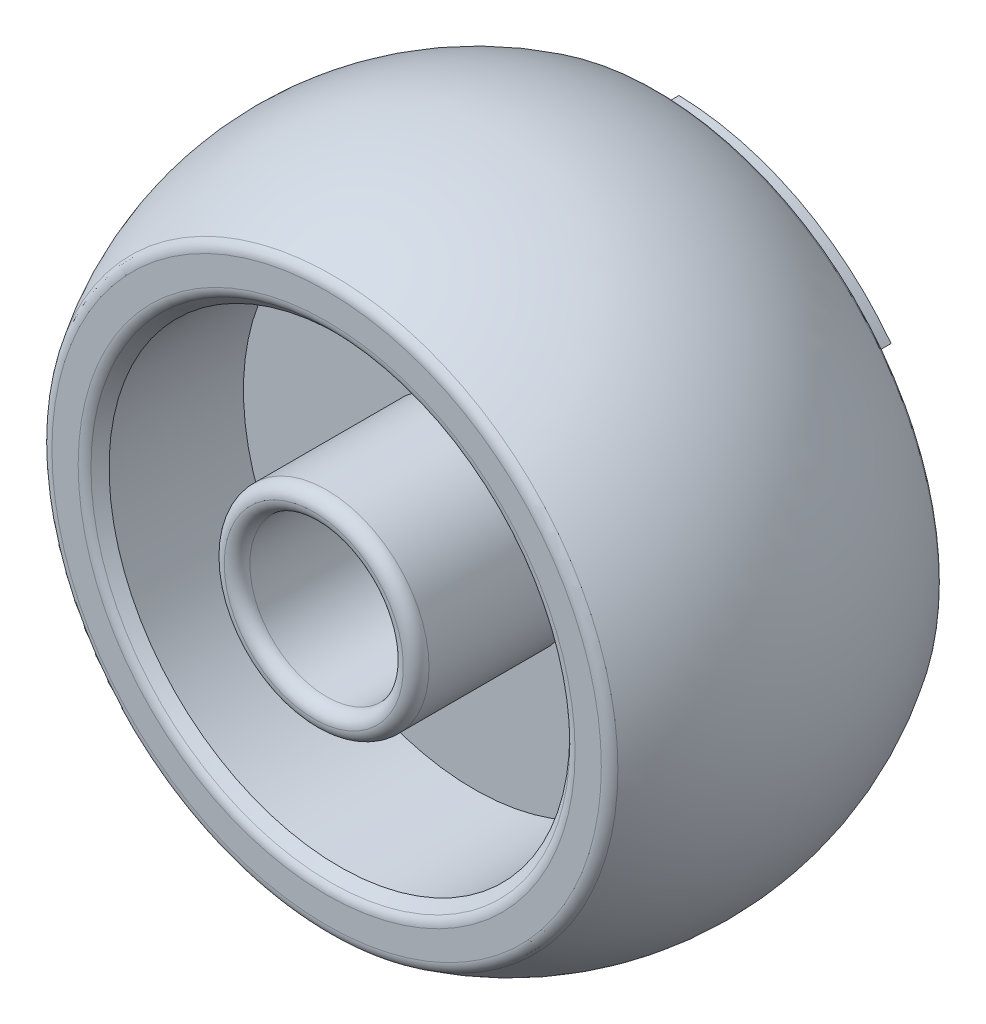
ISO-10303-21;
HEADER;
FILE_DESCRIPTION(('STEP AP214'),'2;1');
FILE_NAME('part.step','',(''),(''),'','','');
FILE_SCHEMA(('AUTOMOTIVE_DESIGN { 1 0 10303 214 1 1 1 1 }'));
ENDSEC;
DATA;
#1=APPLICATION_CONTEXT('core data for automotive mechanical design processes');
#2=APPLICATION_PROTOCOL_DEFINITION('international standard','automotive_design',2000,#1);
#3=PRODUCT_CONTEXT('',#1,'mechanical');
#4=PRODUCT('Part','Part','',(#3));
#5=PRODUCT_RELATED_PRODUCT_CATEGORY('part','',(#4));
#6=PRODUCT_DEFINITION_FORMATION('','',#4);
#7=PRODUCT_DEFINITION_CONTEXT('part definition',#1,'design');
#8=PRODUCT_DEFINITION('design','',#6,#7);
#9=PRODUCT_DEFINITION_SHAPE('','',#8);
#10=(LENGTH_UNIT() NAMED_UNIT(*) SI_UNIT(.MILLI.,.METRE.));
#11=(NAMED_UNIT(*) PLANE_ANGLE_UNIT() SI_UNIT($,.RADIAN.));
#12=(NAMED_UNIT(*) SI_UNIT($,.STERADIAN.) SOLID_ANGLE_UNIT());
#13=UNCERTAINTY_MEASURE_WITH_UNIT(LENGTH_MEASURE(1.E-05),#10,'distance_accuracy_value','');
#14=(GEOMETRIC_REPRESENTATION_CONTEXT(3) GLOBAL_UNCERTAINTY_ASSIGNED_CONTEXT((#13)) GLOBAL_UNIT_ASSIGNED_CONTEXT((#10,
#11,#12)) REPRESENTATION_CONTEXT('',''));
#15=CARTESIAN_POINT('',(0.,0.,0.));
#16=DIRECTION('',(0.,0.,1.));
#17=DIRECTION('',(1.,0.,0.));
#18=AXIS2_PLACEMENT_3D('',#15,#16,#17);
#19=CARTESIAN_POINT('',(0.,19.,-13.));
#20=DIRECTION('',(0.,0.,1.));
#21=DIRECTION('',(1.,0.,0.));
#22=AXIS2_PLACEMENT_3D('',#19,#20,#21);
#23=PLANE('',#22);
#24=DIRECTION('',(0.85329980647171,-0.521420598246121,0.));
#25=VECTOR('',#24,1.);
#26=CARTESIAN_POINT('',(16.5661446755735,-10.1229708501703,-13.));
#27=LINE('',#26,#25);
#28=CARTESIAN_POINT('',(16.5661446755735,-10.1229708501703,-13.));
#29=VERTEX_POINT('',#28);
#30=CARTESIAN_POINT('',(18.31441692079,-11.1912766825215,-13.));
#31=VERTEX_POINT('',#30);
#32=EDGE_CURVE('E53',#29,#31,#27,.T.);
#33=ORIENTED_EDGE('',*,*,#32,.F.);
#34=CARTESIAN_POINT('',(0.,0.,-13.));
#35=DIRECTION('',(0.,0.,1.));
#36=DIRECTION('',(1.,0.,0.));
#37=AXIS2_PLACEMENT_3D('',#34,#35,#36);
#38=CIRCLE('',#37,19.4142135623731);
#39=CARTESIAN_POINT('',(15.4755000882901,11.7226526547008,-13.));
#40=VERTEX_POINT('',#39);
#41=EDGE_CURVE('E268',#29,#40,#38,.T.);
#42=ORIENTED_EDGE('',*,*,#41,.T.);
#43=DIRECTION('',(-0.797122172297691,-0.603818054078718,0.));
#44=VECTOR('',#43,1.);
#45=CARTESIAN_POINT('',(15.4755000882901,11.7226526547008,-13.));
#46=LINE('',#45,#44);
#47=CARTESIAN_POINT('',(17.1086735160881,12.9597774461283,-13.));
#48=VERTEX_POINT('',#47);
#49=EDGE_CURVE('E194',#48,#40,#46,.T.);
#50=ORIENTED_EDGE('',*,*,#49,.F.);
#51=CARTESIAN_POINT('',(0.,0.,-13.));
#52=DIRECTION('',(0.,0.,1.));
#53=DIRECTION('',(1.,0.,0.));
#54=AXIS2_PLACEMENT_3D('',#51,#52,#53);
#55=CIRCLE('',#54,21.4630505970906);
#56=EDGE_CURVE('E269',#48,#31,#55,.F.);
#57=ORIENTED_EDGE('',*,*,#56,.T.);
#58=EDGE_LOOP('',(#33,#42,#50,#57));
#59=FACE_BOUND('',#58,.T.);
#60=ADVANCED_FACE('F38',(#59),#23,.F.);
#61=DIRECTION('',(-0.12436068794702,0.992237078168995,0.));
#62=VECTOR('',#61,1.);
#63=CARTESIAN_POINT('',(2.41436495456709,-19.2635025400779,-13.));
#64=LINE('',#63,#62);
#65=CARTESIAN_POINT('',(2.66915973769589,-21.2964346130505,-13.));
#66=VERTEX_POINT('',#65);
#67=CARTESIAN_POINT('',(2.41436495456709,-19.263502540078,-13.));
#68=VERTEX_POINT('',#67);
#69=EDGE_CURVE('E148',#66,#68,#64,.T.);
#70=ORIENTED_EDGE('',*,*,#69,.F.);
#71=CARTESIAN_POINT('',(-18.8491383682392,-10.2651119676429,-13.));
#72=VERTEX_POINT('',#71);
#73=EDGE_CURVE('E270',#66,#72,#55,.F.);
#74=ORIENTED_EDGE('',*,*,#73,.T.);
#75=DIRECTION('',(-0.878213387373473,-0.478269010325791,0.));
#76=VECTOR('',#75,1.);
#77=CARTESIAN_POINT('',(-17.0498222558037,-9.28521670672971,-13.));
#78=LINE('',#77,#76);
#79=CARTESIAN_POINT('',(-17.0498222558037,-9.28521670672971,-13.));
#80=VERTEX_POINT('',#79);
#81=EDGE_CURVE('E154',#80,#72,#78,.T.);
#82=ORIENTED_EDGE('',*,*,#81,.F.);
#83=EDGE_CURVE('E331',#80,#68,#38,.T.);
#84=ORIENTED_EDGE('',*,*,#83,.T.);
#85=EDGE_LOOP('',(#70,#74,#82,#84));
#86=FACE_BOUND('',#85,.T.);
#87=ADVANCED_FACE('F330',(#86),#23,.F.);
#88=DIRECTION('',(0.921482860244703,-0.388419024090274,0.));
#89=VECTOR('',#88,1.);
#90=CARTESIAN_POINT('',(-17.8898650428571,7.5408498853771,-13.));
#91=LINE('',#90,#89);
#92=CARTESIAN_POINT('',(-19.7778332537838,8.33665716692208,-13.));
#93=VERTEX_POINT('',#92);
#94=CARTESIAN_POINT('',(-17.8898650428571,7.5408498853771,-13.));
#95=VERTEX_POINT('',#94);
#96=EDGE_CURVE('E164',#93,#95,#91,.T.);
#97=ORIENTED_EDGE('',*,*,#96,.F.);
#98=CARTESIAN_POINT('',(0.534721447449292,21.4563886501645,-13.));
#99=VERTEX_POINT('',#98);
#100=EDGE_CURVE('E264',#93,#99,#55,.F.);
#101=ORIENTED_EDGE('',*,*,#100,.T.);
#102=DIRECTION('',(0.0249135809017653,0.999689608571906,0.));
#103=VECTOR('',#102,1.);
#104=CARTESIAN_POINT('',(0.483677580230324,19.4081875569002,-13.));
#105=LINE('',#104,#103);
#106=CARTESIAN_POINT('',(0.483677580230324,19.4081875569002,-13.));
#107=VERTEX_POINT('',#106);
#108=EDGE_CURVE('E189',#107,#99,#105,.T.);
#109=ORIENTED_EDGE('',*,*,#108,.F.);
#110=EDGE_CURVE('E273',#107,#95,#38,.T.);
#111=ORIENTED_EDGE('',*,*,#110,.T.);
#112=EDGE_LOOP('',(#97,#101,#109,#111));
#113=FACE_BOUND('',#112,.T.);
#114=ADVANCED_FACE('F310',(#113),#23,.F.);
#115=CARTESIAN_POINT('',(0.,0.,13.));
#116=DIRECTION('',(0.,0.,1.));
#117=DIRECTION('',(1.,0.,0.));
#118=AXIS2_PLACEMENT_3D('',#115,#116,#117);
#119=CONICAL_SURFACE('',#118,19.,0.785398163397453);
#120=CARTESIAN_POINT('',(0.,0.,12.7071067811865));
#121=DIRECTION('',(0.,0.,-1.));
#122=DIRECTION('',(-1.,0.,0.));
#123=AXIS2_PLACEMENT_3D('',#120,#121,#122);
#124=CIRCLE('',#123,18.7071067811865);
#125=CARTESIAN_POINT('',(-18.7071067811865,0.,12.7071067811865));
#126=VERTEX_POINT('',#125);
#127=EDGE_CURVE('E261',#126,#126,#124,.F.);
#128=ORIENTED_EDGE('',*,*,#127,.T.);
#129=EDGE_LOOP('',(#128));
#130=FACE_BOUND('',#129,.T.);
#131=CARTESIAN_POINT('',(0.,0.,12.));
#132=DIRECTION('',(0.,0.,1.));
#133=DIRECTION('',(1.,0.,0.));
#134=AXIS2_PLACEMENT_3D('',#131,#132,#133);
#135=CIRCLE('',#134,18.);
#136=CARTESIAN_POINT('',(18.,0.,12.));
#137=VERTEX_POINT('',#136);
#138=EDGE_CURVE('E233',#137,#137,#135,.T.);
#139=ORIENTED_EDGE('',*,*,#138,.F.);
#140=EDGE_LOOP('',(#139));
#141=FACE_BOUND('',#140,.T.);
#142=ADVANCED_FACE('F365',(#130,#141),#119,.F.);
#143=CARTESIAN_POINT('',(0.,0.,9.42942299976632));
#144=DIRECTION('',(0.,0.,1.));
#145=DIRECTION('',(1.,0.,0.));
#146=AXIS2_PLACEMENT_3D('',#143,#144,#145);
#147=CYLINDRICAL_SURFACE('',#146,18.);
#148=CARTESIAN_POINT('',(0.,0.,1.5));
#149=DIRECTION('',(0.,0.,1.));
#150=DIRECTION('',(1.,0.,0.));
#151=AXIS2_PLACEMENT_3D('',#148,#149,#150);
#152=CIRCLE('',#151,18.);
#153=CARTESIAN_POINT('',(18.,0.,1.5));
#154=VERTEX_POINT('',#153);
#155=EDGE_CURVE('E230',#154,#154,#152,.T.);
#156=ORIENTED_EDGE('',*,*,#155,.F.);
#157=EDGE_LOOP('',(#156));
#158=FACE_BOUND('',#157,.T.);
#159=ORIENTED_EDGE('',*,*,#138,.T.);
#160=EDGE_LOOP('',(#159));
#161=FACE_BOUND('',#160,.T.);
#162=ADVANCED_FACE('F369',(#158,#161),#147,.F.);
#163=CARTESIAN_POINT('',(0.,8.,1.5));
#164=DIRECTION('',(0.,0.,-1.));
#165=DIRECTION('',(-1.,0.,0.));
#166=AXIS2_PLACEMENT_3D('',#163,#164,#165);
#167=PLANE('',#166);
#168=CARTESIAN_POINT('',(0.,0.,1.5));
#169=DIRECTION('',(0.,0.,1.));
#170=DIRECTION('',(1.,0.,0.));
#171=AXIS2_PLACEMENT_3D('',#168,#169,#170);
#172=CIRCLE('',#171,8.);
#173=CARTESIAN_POINT('',(8.,0.,1.5));
#174=VERTEX_POINT('',#173);
#175=EDGE_CURVE('E227',#174,#174,#172,.T.);
#176=ORIENTED_EDGE('',*,*,#175,.F.);
#177=EDGE_LOOP('',(#176));
#178=FACE_BOUND('',#177,.T.);
#179=ORIENTED_EDGE('',*,*,#155,.T.);
#180=EDGE_LOOP('',(#179));
#181=FACE_BOUND('',#180,.T.);
#182=ADVANCED_FACE('F375',(#178,#181),#167,.F.);
#183=CARTESIAN_POINT('',(0.,0.,9.42942299976632));
#184=DIRECTION('',(0.,0.,1.));
#185=DIRECTION('',(1.,0.,0.));
#186=AXIS2_PLACEMENT_3D('',#183,#184,#185);
#187=CYLINDRICAL_SURFACE('',#186,8.);
#188=CARTESIAN_POINT('',(0.,0.,13.));
#189=DIRECTION('',(0.,0.,-1.));
#190=DIRECTION('',(-1.,0.,0.));
#191=AXIS2_PLACEMENT_3D('',#188,#189,#190);
#192=CIRCLE('',#191,8.);
#193=CARTESIAN_POINT('',(-8.,0.,13.));
#194=VERTEX_POINT('',#193);
#195=EDGE_CURVE('E242',#194,#194,#192,.T.);
#196=ORIENTED_EDGE('',*,*,#195,.T.);
#197=EDGE_LOOP('',(#196));
#198=FACE_BOUND('',#197,.T.);
#199=ORIENTED_EDGE('',*,*,#175,.T.);
#200=EDGE_LOOP('',(#199));
#201=FACE_BOUND('',#200,.T.);
#202=ADVANCED_FACE('F556',(#198,#201),#187,.T.);
#203=CARTESIAN_POINT('',(0.,0.,9.42942299976632));
#204=DIRECTION('',(0.,0.,1.));
#205=DIRECTION('',(1.,0.,0.));
#206=AXIS2_PLACEMENT_3D('',#203,#204,#205);
#207=CYLINDRICAL_SURFACE('',#206,6.);
#208=CARTESIAN_POINT('',(0.,0.,13.));
#209=DIRECTION('',(0.,0.,-1.));
#210=DIRECTION('',(-1.,0.,0.));
#211=AXIS2_PLACEMENT_3D('',#208,#209,#210);
#212=CIRCLE('',#211,6.);
#213=CARTESIAN_POINT('',(-6.,0.,13.));
#214=VERTEX_POINT('',#213);
#215=EDGE_CURVE('E247',#214,#214,#212,.F.);
#216=ORIENTED_EDGE('',*,*,#215,.T.);
#217=EDGE_LOOP('',(#216));
#218=FACE_BOUND('',#217,.T.);
#219=CARTESIAN_POINT('',(0.,0.,-13.));
#220=DIRECTION('',(0.,0.,1.));
#221=DIRECTION('',(1.,0.,0.));
#222=AXIS2_PLACEMENT_3D('',#219,#220,#221);
#223=CIRCLE('',#222,6.);
#224=CARTESIAN_POINT('',(6.,0.,-13.));
#225=VERTEX_POINT('',#224);
#226=EDGE_CURVE('E236',#225,#225,#223,.F.);
#227=ORIENTED_EDGE('',*,*,#226,.T.);
#228=EDGE_LOOP('',(#227));
#229=FACE_BOUND('',#228,.T.);
#230=ADVANCED_FACE('F565',(#218,#229),#207,.F.);
#231=CARTESIAN_POINT('',(0.,0.,9.42942299976632));
#232=DIRECTION('',(0.,0.,1.));
#233=DIRECTION('',(1.,0.,0.));
#234=AXIS2_PLACEMENT_3D('',#231,#232,#233);
#235=CYLINDRICAL_SURFACE('',#234,8.);
#236=CARTESIAN_POINT('',(0.,0.,-13.));
#237=DIRECTION('',(0.,0.,1.));
#238=DIRECTION('',(1.,0.,0.));
#239=AXIS2_PLACEMENT_3D('',#236,#237,#238);
#240=CIRCLE('',#239,8.);
#241=CARTESIAN_POINT('',(8.,0.,-13.));
#242=VERTEX_POINT('',#241);
#243=EDGE_CURVE('E239',#242,#242,#240,.T.);
#244=ORIENTED_EDGE('',*,*,#243,.T.);
#245=EDGE_LOOP('',(#244));
#246=FACE_BOUND('',#245,.T.);
#247=CARTESIAN_POINT('',(0.,0.,-1.5));
#248=DIRECTION('',(0.,0.,1.));
#249=DIRECTION('',(1.,0.,0.));
#250=AXIS2_PLACEMENT_3D('',#247,#248,#249);
#251=CIRCLE('',#250,8.);
#252=CARTESIAN_POINT('',(8.,0.,-1.5));
#253=VERTEX_POINT('',#252);
#254=EDGE_CURVE('E224',#253,#253,#251,.T.);
#255=ORIENTED_EDGE('',*,*,#254,.F.);
#256=EDGE_LOOP('',(#255));
#257=FACE_BOUND('',#256,.T.);
#258=ADVANCED_FACE('F637',(#246,#257),#235,.T.);
#259=CARTESIAN_POINT('',(0.,8.,-1.5));
#260=DIRECTION('',(0.,0.,1.));
#261=DIRECTION('',(1.,0.,0.));
#262=AXIS2_PLACEMENT_3D('',#259,#260,#261);
#263=PLANE('',#262);
#264=CARTESIAN_POINT('',(0.,0.,-1.5));
#265=DIRECTION('',(0.,0.,1.));
#266=DIRECTION('',(1.,0.,0.));
#267=AXIS2_PLACEMENT_3D('',#264,#265,#266);
#268=CIRCLE('',#267,18.);
#269=CARTESIAN_POINT('',(18.,0.,-1.5));
#270=VERTEX_POINT('',#269);
#271=EDGE_CURVE('E220',#270,#270,#268,.T.);
#272=ORIENTED_EDGE('',*,*,#271,.F.);
#273=EDGE_LOOP('',(#272));
#274=FACE_BOUND('',#273,.T.);
#275=ORIENTED_EDGE('',*,*,#254,.T.);
#276=EDGE_LOOP('',(#275));
#277=FACE_BOUND('',#276,.T.);
#278=ADVANCED_FACE('F646',(#274,#277),#263,.F.);
#279=CARTESIAN_POINT('',(0.,0.,9.42942299976632));
#280=DIRECTION('',(0.,0.,1.));
#281=DIRECTION('',(1.,0.,0.));
#282=AXIS2_PLACEMENT_3D('',#279,#280,#281);
#283=CYLINDRICAL_SURFACE('',#282,18.);
#284=CARTESIAN_POINT('',(0.,0.,-12.));
#285=DIRECTION('',(0.,0.,1.));
#286=DIRECTION('',(1.,0.,0.));
#287=AXIS2_PLACEMENT_3D('',#284,#285,#286);
#288=CIRCLE('',#287,18.);
#289=CARTESIAN_POINT('',(18.,0.,-12.));
#290=VERTEX_POINT('',#289);
#291=EDGE_CURVE('E217',#290,#290,#288,.T.);
#292=ORIENTED_EDGE('',*,*,#291,.F.);
#293=EDGE_LOOP('',(#292));
#294=FACE_BOUND('',#293,.T.);
#295=ORIENTED_EDGE('',*,*,#271,.T.);
#296=EDGE_LOOP('',(#295));
#297=FACE_BOUND('',#296,.T.);
#298=ADVANCED_FACE('F581',(#294,#297),#283,.F.);
#299=CARTESIAN_POINT('',(0.,0.,-12.));
#300=DIRECTION('',(0.,0.,-1.));
#301=DIRECTION('',(-1.,0.,0.));
#302=AXIS2_PLACEMENT_3D('',#299,#300,#301);
#303=CONICAL_SURFACE('',#302,18.,0.785398163397448);
#304=CARTESIAN_POINT('',(0.,0.,-12.7071067811865));
#305=DIRECTION('',(0.,0.,1.));
#306=DIRECTION('',(1.,0.,0.));
#307=AXIS2_PLACEMENT_3D('',#304,#305,#306);
#308=CIRCLE('',#307,18.7071067811865);
#309=CARTESIAN_POINT('',(18.7071067811865,0.,-12.7071067811865));
#310=VERTEX_POINT('',#309);
#311=EDGE_CURVE('E46',#310,#310,#308,.F.);
#312=ORIENTED_EDGE('',*,*,#311,.T.);
#313=EDGE_LOOP('',(#312));
#314=FACE_BOUND('',#313,.T.);
#315=ORIENTED_EDGE('',*,*,#291,.T.);
#316=EDGE_LOOP('',(#315));
#317=FACE_BOUND('',#316,.T.);
#318=ADVANCED_FACE('F277',(#314,#317),#303,.F.);
#319=CARTESIAN_POINT('',(0.,0.,0.));
#320=DIRECTION('',(0.,0.,1.));
#321=DIRECTION('',(1.,0.,0.));
#322=AXIS2_PLACEMENT_3D('',#319,#320,#321);
#323=DEGENERATE_TOROIDAL_SURFACE('',#322,2.87499999999996,23.125,.T.);
#324=CARTESIAN_POINT('',(0.,0.,-12.5423728813559));
#325=DIRECTION('',(0.,0.,1.));
#326=DIRECTION('',(1.,0.,0.));
#327=AXIS2_PLACEMENT_3D('',#324,#325,#326);
#328=CIRCLE('',#327,22.3031884771851);
#329=CARTESIAN_POINT('',(22.3031884771851,0.,-12.5423728813559));
#330=VERTEX_POINT('',#329);
#331=EDGE_CURVE('E11',#330,#330,#328,.T.);
#332=ORIENTED_EDGE('',*,*,#331,.T.);
#333=EDGE_LOOP('',(#332));
#334=FACE_BOUND('',#333,.T.);
#335=CARTESIAN_POINT('',(0.,0.,12.5423728813559));
#336=DIRECTION('',(0.,0.,-1.));
#337=DIRECTION('',(-1.,0.,0.));
#338=AXIS2_PLACEMENT_3D('',#335,#336,#337);
#339=CIRCLE('',#338,22.3031884771851);
#340=CARTESIAN_POINT('',(-22.3031884771851,0.,12.5423728813559));
#341=VERTEX_POINT('',#340);
#342=EDGE_CURVE('E258',#341,#341,#339,.T.);
#343=ORIENTED_EDGE('',*,*,#342,.T.);
#344=EDGE_LOOP('',(#343));
#345=FACE_BOUND('',#344,.T.);
#346=ADVANCED_FACE('F411',(#334,#345),#323,.T.);
#347=CARTESIAN_POINT('',(0.,19.,13.));
#348=DIRECTION('',(0.,0.,-1.));
#349=DIRECTION('',(-1.,0.,0.));
#350=AXIS2_PLACEMENT_3D('',#347,#348,#349);
#351=PLANE('',#350);
#352=CARTESIAN_POINT('',(0.,0.,13.));
#353=DIRECTION('',(0.,0.,-1.));
#354=DIRECTION('',(-1.,0.,0.));
#355=AXIS2_PLACEMENT_3D('',#352,#353,#354);
#356=CIRCLE('',#355,21.4630505970906);
#357=CARTESIAN_POINT('',(-21.4630505970906,0.,13.));
#358=VERTEX_POINT('',#357);
#359=EDGE_CURVE('E255',#358,#358,#356,.F.);
#360=ORIENTED_EDGE('',*,*,#359,.T.);
#361=EDGE_LOOP('',(#360));
#362=FACE_BOUND('',#361,.T.);
#363=CARTESIAN_POINT('',(0.,0.,13.));
#364=DIRECTION('',(0.,0.,-1.));
#365=DIRECTION('',(-1.,0.,0.));
#366=AXIS2_PLACEMENT_3D('',#363,#364,#365);
#367=CIRCLE('',#366,19.4142135623731);
#368=CARTESIAN_POINT('',(-19.4142135623731,0.,13.));
#369=VERTEX_POINT('',#368);
#370=EDGE_CURVE('E250',#369,#369,#367,.T.);
#371=ORIENTED_EDGE('',*,*,#370,.T.);
#372=EDGE_LOOP('',(#371));
#373=FACE_BOUND('',#372,.T.);
#374=ADVANCED_FACE('F389',(#362,#373),#351,.F.);
#375=CARTESIAN_POINT('',(0.,0.,-13.));
#376=DIRECTION('',(0.,0.,1.));
#377=DIRECTION('',(1.,0.,0.));
#378=AXIS2_PLACEMENT_3D('',#375,#376,#377);
#379=TOROIDAL_SURFACE('',#378,7.,1.);
#380=ORIENTED_EDGE('',*,*,#243,.F.);
#381=EDGE_LOOP('',(#380));
#382=FACE_BOUND('',#381,.T.);
#383=CARTESIAN_POINT('',(0.,0.,-14.));
#384=DIRECTION('',(0.,0.,1.));
#385=DIRECTION('',(1.,0.,0.));
#386=AXIS2_PLACEMENT_3D('',#383,#384,#385);
#387=CIRCLE('',#386,7.);
#388=CARTESIAN_POINT('',(7.,0.,-14.));
#389=VERTEX_POINT('',#388);
#390=EDGE_CURVE('E221',#389,#389,#387,.F.);
#391=ORIENTED_EDGE('',*,*,#390,.F.);
#392=EDGE_LOOP('',(#391));
#393=FACE_BOUND('',#392,.T.);
#394=ADVANCED_FACE('F385',(#382,#393),#379,.T.);
#395=CARTESIAN_POINT('',(0.,0.,-13.));
#396=DIRECTION('',(0.,0.,1.));
#397=DIRECTION('',(1.,0.,0.));
#398=AXIS2_PLACEMENT_3D('',#395,#396,#397);
#399=TOROIDAL_SURFACE('',#398,7.,1.);
#400=ORIENTED_EDGE('',*,*,#226,.F.);
#401=EDGE_LOOP('',(#400));
#402=FACE_BOUND('',#401,.T.);
#403=ORIENTED_EDGE('',*,*,#390,.T.);
#404=EDGE_LOOP('',(#403));
#405=FACE_BOUND('',#404,.T.);
#406=ADVANCED_FACE('F381',(#402,#405),#399,.T.);
#407=CARTESIAN_POINT('',(0.,0.,13.));
#408=DIRECTION('',(0.,0.,-1.));
#409=DIRECTION('',(-1.,0.,0.));
#410=AXIS2_PLACEMENT_3D('',#407,#408,#409);
#411=TOROIDAL_SURFACE('',#410,7.,1.);
#412=ORIENTED_EDGE('',*,*,#215,.F.);
#413=EDGE_LOOP('',(#412));
#414=FACE_BOUND('',#413,.T.);
#415=CARTESIAN_POINT('',(0.,0.,14.));
#416=DIRECTION('',(0.,0.,-1.));
#417=DIRECTION('',(-1.,0.,0.));
#418=AXIS2_PLACEMENT_3D('',#415,#416,#417);
#419=CIRCLE('',#418,7.);
#420=CARTESIAN_POINT('',(-7.,0.,14.));
#421=VERTEX_POINT('',#420);
#422=EDGE_CURVE('E216',#421,#421,#419,.T.);
#423=ORIENTED_EDGE('',*,*,#422,.F.);
#424=EDGE_LOOP('',(#423));
#425=FACE_BOUND('',#424,.T.);
#426=ADVANCED_FACE('F384',(#414,#425),#411,.T.);
#427=CARTESIAN_POINT('',(0.,0.,13.));
#428=DIRECTION('',(0.,0.,-1.));
#429=DIRECTION('',(-1.,0.,0.));
#430=AXIS2_PLACEMENT_3D('',#427,#428,#429);
#431=TOROIDAL_SURFACE('',#430,7.,1.);
#432=ORIENTED_EDGE('',*,*,#195,.F.);
#433=EDGE_LOOP('',(#432));
#434=FACE_BOUND('',#433,.T.);
#435=ORIENTED_EDGE('',*,*,#422,.T.);
#436=EDGE_LOOP('',(#435));
#437=FACE_BOUND('',#436,.T.);
#438=ADVANCED_FACE('F391',(#434,#437),#431,.T.);
#439=CARTESIAN_POINT('',(0.,0.,12.));
#440=DIRECTION('',(0.,0.,-1.));
#441=DIRECTION('',(-1.,0.,0.));
#442=AXIS2_PLACEMENT_3D('',#439,#440,#441);
#443=TOROIDAL_SURFACE('',#442,21.4630505970906,1.);
#444=ORIENTED_EDGE('',*,*,#342,.F.);
#445=EDGE_LOOP('',(#444));
#446=FACE_BOUND('',#445,.T.);
#447=ORIENTED_EDGE('',*,*,#359,.F.);
#448=EDGE_LOOP('',(#447));
#449=FACE_BOUND('',#448,.T.);
#450=ADVANCED_FACE('F394',(#446,#449),#443,.T.);
#451=CARTESIAN_POINT('',(0.,0.,12.));
#452=DIRECTION('',(0.,0.,-1.));
#453=DIRECTION('',(-1.,0.,0.));
#454=AXIS2_PLACEMENT_3D('',#451,#452,#453);
#455=TOROIDAL_SURFACE('',#454,19.4142135623731,1.);
#456=ORIENTED_EDGE('',*,*,#370,.F.);
#457=EDGE_LOOP('',(#456));
#458=FACE_BOUND('',#457,.T.);
#459=ORIENTED_EDGE('',*,*,#127,.F.);
#460=EDGE_LOOP('',(#459));
#461=FACE_BOUND('',#460,.T.);
#462=ADVANCED_FACE('F282',(#458,#461),#455,.T.);
#463=CARTESIAN_POINT('',(0.,0.,-12.));
#464=DIRECTION('',(0.,0.,1.));
#465=DIRECTION('',(1.,0.,0.));
#466=AXIS2_PLACEMENT_3D('',#463,#464,#465);
#467=TOROIDAL_SURFACE('',#466,19.4142135623731,1.);
#468=ORIENTED_EDGE('',*,*,#311,.F.);
#469=EDGE_LOOP('',(#468));
#470=FACE_BOUND('',#469,.T.);
#471=EDGE_CURVE('E271',#40,#107,#38,.T.);
#472=ORIENTED_EDGE('',*,*,#471,.F.);
#473=ORIENTED_EDGE('',*,*,#41,.F.);
#474=CARTESIAN_POINT('',(0.,0.,-13.));
#475=DIRECTION('',(0.,0.,1.));
#476=DIRECTION('',(-1.,0.,0.));
#477=AXIS2_PLACEMENT_3D('',#474,#475,#476);
#478=CIRCLE('',#477,19.4142135623731);
#479=EDGE_CURVE('E60',#68,#29,#478,.T.);
#480=ORIENTED_EDGE('',*,*,#479,.F.);
#481=ORIENTED_EDGE('',*,*,#83,.F.);
#482=CARTESIAN_POINT('',(0.,0.,-13.));
#483=DIRECTION('',(0.,0.,1.));
#484=DIRECTION('',(-1.,0.,0.));
#485=AXIS2_PLACEMENT_3D('',#482,#483,#484);
#486=CIRCLE('',#485,19.4142135623731);
#487=EDGE_CURVE('E151',#95,#80,#486,.T.);
#488=ORIENTED_EDGE('',*,*,#487,.F.);
#489=ORIENTED_EDGE('',*,*,#110,.F.);
#490=EDGE_LOOP('',(#472,#473,#480,#481,#488,#489));
#491=FACE_BOUND('',#490,.T.);
#492=ADVANCED_FACE('F280',(#470,#491),#467,.T.);
#493=CARTESIAN_POINT('',(0.,0.,-12.));
#494=DIRECTION('',(0.,0.,1.));
#495=DIRECTION('',(1.,0.,0.));
#496=AXIS2_PLACEMENT_3D('',#493,#494,#495);
#497=TOROIDAL_SURFACE('',#496,21.4630505970906,1.);
#498=EDGE_CURVE('E265',#99,#48,#55,.F.);
#499=ORIENTED_EDGE('',*,*,#498,.F.);
#500=ORIENTED_EDGE('',*,*,#100,.F.);
#501=CARTESIAN_POINT('',(0.,0.,-13.));
#502=DIRECTION('',(0.,0.,-1.));
#503=DIRECTION('',(-1.,0.,0.));
#504=AXIS2_PLACEMENT_3D('',#501,#502,#503);
#505=CIRCLE('',#504,21.4630505970906);
#506=EDGE_CURVE('E173',#72,#93,#505,.T.);
#507=ORIENTED_EDGE('',*,*,#506,.F.);
#508=ORIENTED_EDGE('',*,*,#73,.F.);
#509=CARTESIAN_POINT('',(0.,0.,-13.));
#510=DIRECTION('',(0.,0.,-1.));
#511=DIRECTION('',(-1.,0.,0.));
#512=AXIS2_PLACEMENT_3D('',#509,#510,#511);
#513=CIRCLE('',#512,21.4630505970906);
#514=EDGE_CURVE('E311',#31,#66,#513,.T.);
#515=ORIENTED_EDGE('',*,*,#514,.F.);
#516=ORIENTED_EDGE('',*,*,#56,.F.);
#517=EDGE_LOOP('',(#499,#500,#507,#508,#515,#516));
#518=FACE_BOUND('',#517,.T.);
#519=ORIENTED_EDGE('',*,*,#331,.F.);
#520=EDGE_LOOP('',(#519));
#521=FACE_BOUND('',#520,.T.);
#522=ADVANCED_FACE('F40',(#518,#521),#497,.T.);
#523=CARTESIAN_POINT('',(0.,0.,-14.));
#524=DIRECTION('',(0.,0.,1.));
#525=DIRECTION('',(1.,0.,0.));
#526=AXIS2_PLACEMENT_3D('',#523,#524,#525);
#527=CYLINDRICAL_SURFACE('',#526,19.4142135623731);
#528=ORIENTED_EDGE('',*,*,#471,.T.);
#529=DIRECTION('',(0.,0.,1.));
#530=VECTOR('',#529,1.);
#531=CARTESIAN_POINT('',(0.483677580230324,19.4081875569002,-14.));
#532=LINE('',#531,#530);
#533=CARTESIAN_POINT('',(0.483677580230324,19.4081875569002,-14.));
#534=VERTEX_POINT('',#533);
#535=EDGE_CURVE('E213',#534,#107,#532,.T.);
#536=ORIENTED_EDGE('',*,*,#535,.F.);
#537=CARTESIAN_POINT('',(0.,0.,-14.));
#538=DIRECTION('',(0.,0.,1.));
#539=DIRECTION('',(-1.,0.,0.));
#540=AXIS2_PLACEMENT_3D('',#537,#538,#539);
#541=CIRCLE('',#540,19.4142135623731);
#542=CARTESIAN_POINT('',(15.4755000882901,11.7226526547008,-14.));
#543=VERTEX_POINT('',#542);
#544=EDGE_CURVE('E190',#543,#534,#541,.T.);
#545=ORIENTED_EDGE('',*,*,#544,.F.);
#546=DIRECTION('',(0.,0.,1.));
#547=VECTOR('',#546,1.);
#548=CARTESIAN_POINT('',(15.4755000882901,11.7226526547008,-14.));
#549=LINE('',#548,#547);
#550=EDGE_CURVE('E200',#543,#40,#549,.T.);
#551=ORIENTED_EDGE('',*,*,#550,.T.);
#552=EDGE_LOOP('',(#528,#536,#545,#551));
#553=FACE_BOUND('',#552,.T.);
#554=ADVANCED_FACE('F295',(#553),#527,.F.);
#555=CARTESIAN_POINT('',(0.483677580230324,19.4081875569002,-14.));
#556=DIRECTION('',(0.999689608571906,-0.0249135809017653,0.));
#557=DIRECTION('',(0.0249135809017653,0.999689608571906,0.));
#558=AXIS2_PLACEMENT_3D('',#555,#556,#557);
#559=PLANE('',#558);
#560=ORIENTED_EDGE('',*,*,#108,.T.);
#561=DIRECTION('',(0.,0.,1.));
#562=VECTOR('',#561,1.);
#563=CARTESIAN_POINT('',(0.534721447449292,21.4563886501645,-14.));
#564=LINE('',#563,#562);
#565=CARTESIAN_POINT('',(0.534721447449292,21.4563886501645,-14.));
#566=VERTEX_POINT('',#565);
#567=EDGE_CURVE('E210',#566,#99,#564,.T.);
#568=ORIENTED_EDGE('',*,*,#567,.F.);
#569=DIRECTION('',(0.0249135809017653,0.999689608571906,0.));
#570=VECTOR('',#569,1.);
#571=CARTESIAN_POINT('',(0.483677580230324,19.4081875569002,-14.));
#572=LINE('',#571,#570);
#573=EDGE_CURVE('E193',#534,#566,#572,.T.);
#574=ORIENTED_EDGE('',*,*,#573,.F.);
#575=ORIENTED_EDGE('',*,*,#535,.T.);
#576=EDGE_LOOP('',(#560,#568,#574,#575));
#577=FACE_BOUND('',#576,.T.);
#578=ADVANCED_FACE('F308',(#577),#559,.F.);
#579=CARTESIAN_POINT('',(0.,0.,-14.));
#580=DIRECTION('',(0.,0.,1.));
#581=DIRECTION('',(1.,0.,0.));
#582=AXIS2_PLACEMENT_3D('',#579,#580,#581);
#583=CYLINDRICAL_SURFACE('',#582,21.4630505970906);
#584=ORIENTED_EDGE('',*,*,#498,.T.);
#585=DIRECTION('',(0.,0.,1.));
#586=VECTOR('',#585,1.);
#587=CARTESIAN_POINT('',(17.1086735160881,12.9597774461283,-14.));
#588=LINE('',#587,#586);
#589=CARTESIAN_POINT('',(17.1086735160881,12.9597774461283,-14.));
#590=VERTEX_POINT('',#589);
#591=EDGE_CURVE('E207',#590,#48,#588,.T.);
#592=ORIENTED_EDGE('',*,*,#591,.F.);
#593=CARTESIAN_POINT('',(0.,0.,-14.));
#594=DIRECTION('',(0.,0.,-1.));
#595=DIRECTION('',(-1.,0.,0.));
#596=AXIS2_PLACEMENT_3D('',#593,#594,#595);
#597=CIRCLE('',#596,21.4630505970906);
#598=EDGE_CURVE('E196',#566,#590,#597,.T.);
#599=ORIENTED_EDGE('',*,*,#598,.F.);
#600=ORIENTED_EDGE('',*,*,#567,.T.);
#601=EDGE_LOOP('',(#584,#592,#599,#600));
#602=FACE_BOUND('',#601,.T.);
#603=ADVANCED_FACE('F301',(#602),#583,.T.);
#604=CARTESIAN_POINT('',(15.4755000882901,11.7226526547008,-14.));
#605=DIRECTION('',(-0.603818054078718,0.797122172297691,0.));
#606=DIRECTION('',(-0.797122172297691,-0.603818054078718,0.));
#607=AXIS2_PLACEMENT_3D('',#604,#605,#606);
#608=PLANE('',#607);
#609=ORIENTED_EDGE('',*,*,#49,.T.);
#610=ORIENTED_EDGE('',*,*,#550,.F.);
#611=DIRECTION('',(-0.797122172297691,-0.603818054078718,0.));
#612=VECTOR('',#611,1.);
#613=CARTESIAN_POINT('',(15.4755000882901,11.7226526547008,-14.));
#614=LINE('',#613,#612);
#615=EDGE_CURVE('E198',#590,#543,#614,.T.);
#616=ORIENTED_EDGE('',*,*,#615,.F.);
#617=ORIENTED_EDGE('',*,*,#591,.T.);
#618=EDGE_LOOP('',(#609,#610,#616,#617));
#619=FACE_BOUND('',#618,.T.);
#620=ADVANCED_FACE('F291',(#619),#608,.F.);
#621=CARTESIAN_POINT('',(0.,0.,-14.));
#622=DIRECTION('',(0.,0.,-1.));
#623=DIRECTION('',(-1.,0.,0.));
#624=AXIS2_PLACEMENT_3D('',#621,#622,#623);
#625=PLANE('',#624);
#626=ORIENTED_EDGE('',*,*,#544,.T.);
#627=ORIENTED_EDGE('',*,*,#573,.T.);
#628=ORIENTED_EDGE('',*,*,#598,.T.);
#629=ORIENTED_EDGE('',*,*,#615,.T.);
#630=EDGE_LOOP('',(#626,#627,#628,#629));
#631=FACE_BOUND('',#630,.T.);
#632=ADVANCED_FACE('F297',(#631),#625,.T.);
#633=CARTESIAN_POINT('',(0.,0.,-14.));
#634=DIRECTION('',(0.,0.,1.));
#635=DIRECTION('',(1.,0.,0.));
#636=AXIS2_PLACEMENT_3D('',#633,#634,#635);
#637=CYLINDRICAL_SURFACE('',#636,19.4142135623731);
#638=ORIENTED_EDGE('',*,*,#487,.T.);
#639=DIRECTION('',(0.,0.,1.));
#640=VECTOR('',#639,1.);
#641=CARTESIAN_POINT('',(-17.0498222558037,-9.28521670672971,-14.));
#642=LINE('',#641,#640);
#643=CARTESIAN_POINT('',(-17.0498222558037,-9.28521670672971,-14.));
#644=VERTEX_POINT('',#643);
#645=EDGE_CURVE('E186',#644,#80,#642,.T.);
#646=ORIENTED_EDGE('',*,*,#645,.F.);
#647=CARTESIAN_POINT('',(0.,0.,-14.));
#648=DIRECTION('',(0.,0.,1.));
#649=DIRECTION('',(-1.,0.,0.));
#650=AXIS2_PLACEMENT_3D('',#647,#648,#649);
#651=CIRCLE('',#650,19.4142135623731);
#652=CARTESIAN_POINT('',(-17.8898650428571,7.5408498853771,-14.));
#653=VERTEX_POINT('',#652);
#654=EDGE_CURVE('E160',#653,#644,#651,.T.);
#655=ORIENTED_EDGE('',*,*,#654,.F.);
#656=DIRECTION('',(0.,0.,1.));
#657=VECTOR('',#656,1.);
#658=CARTESIAN_POINT('',(-17.8898650428571,7.5408498853771,-14.));
#659=LINE('',#658,#657);
#660=EDGE_CURVE('E169',#653,#95,#659,.T.);
#661=ORIENTED_EDGE('',*,*,#660,.T.);
#662=EDGE_LOOP('',(#638,#646,#655,#661));
#663=FACE_BOUND('',#662,.T.);
#664=ADVANCED_FACE('F338',(#663),#637,.F.);
#665=CARTESIAN_POINT('',(-17.0498222558037,-9.28521670672971,-14.));
#666=DIRECTION('',(-0.478269010325791,0.878213387373473,0.));
#667=DIRECTION('',(-0.878213387373473,-0.478269010325791,0.));
#668=AXIS2_PLACEMENT_3D('',#665,#666,#667);
#669=PLANE('',#668);
#670=ORIENTED_EDGE('',*,*,#81,.T.);
#671=DIRECTION('',(0.,0.,1.));
#672=VECTOR('',#671,1.);
#673=CARTESIAN_POINT('',(-18.8491383682392,-10.2651119676429,-14.));
#674=LINE('',#673,#672);
#675=CARTESIAN_POINT('',(-18.8491383682392,-10.2651119676429,-14.));
#676=VERTEX_POINT('',#675);
#677=EDGE_CURVE('E183',#676,#72,#674,.T.);
#678=ORIENTED_EDGE('',*,*,#677,.F.);
#679=DIRECTION('',(-0.878213387373473,-0.478269010325791,0.));
#680=VECTOR('',#679,1.);
#681=CARTESIAN_POINT('',(-17.0498222558037,-9.28521670672971,-14.));
#682=LINE('',#681,#680);
#683=EDGE_CURVE('E163',#644,#676,#682,.T.);
#684=ORIENTED_EDGE('',*,*,#683,.F.);
#685=ORIENTED_EDGE('',*,*,#645,.T.);
#686=EDGE_LOOP('',(#670,#678,#684,#685));
#687=FACE_BOUND('',#686,.T.);
#688=ADVANCED_FACE('F334',(#687),#669,.F.);
#689=CARTESIAN_POINT('',(0.,0.,-14.));
#690=DIRECTION('',(0.,0.,1.));
#691=DIRECTION('',(1.,0.,0.));
#692=AXIS2_PLACEMENT_3D('',#689,#690,#691);
#693=CYLINDRICAL_SURFACE('',#692,21.4630505970906);
#694=ORIENTED_EDGE('',*,*,#506,.T.);
#695=DIRECTION('',(0.,0.,1.));
#696=VECTOR('',#695,1.);
#697=CARTESIAN_POINT('',(-19.7778332537838,8.33665716692208,-14.));
#698=LINE('',#697,#696);
#699=CARTESIAN_POINT('',(-19.7778332537838,8.33665716692208,-14.));
#700=VERTEX_POINT('',#699);
#701=EDGE_CURVE('E180',#700,#93,#698,.T.);
#702=ORIENTED_EDGE('',*,*,#701,.F.);
#703=CARTESIAN_POINT('',(0.,0.,-14.));
#704=DIRECTION('',(0.,0.,-1.));
#705=DIRECTION('',(-1.,0.,0.));
#706=AXIS2_PLACEMENT_3D('',#703,#704,#705);
#707=CIRCLE('',#706,21.4630505970906);
#708=EDGE_CURVE('E166',#676,#700,#707,.T.);
#709=ORIENTED_EDGE('',*,*,#708,.F.);
#710=ORIENTED_EDGE('',*,*,#677,.T.);
#711=EDGE_LOOP('',(#694,#702,#709,#710));
#712=FACE_BOUND('',#711,.T.);
#713=ADVANCED_FACE('F346',(#712),#693,.T.);
#714=CARTESIAN_POINT('',(-17.8898650428571,7.5408498853771,-14.));
#715=DIRECTION('',(-0.388419024090274,-0.921482860244703,0.));
#716=DIRECTION('',(0.921482860244703,-0.388419024090274,0.));
#717=AXIS2_PLACEMENT_3D('',#714,#715,#716);
#718=PLANE('',#717);
#719=ORIENTED_EDGE('',*,*,#96,.T.);
#720=ORIENTED_EDGE('',*,*,#660,.F.);
#721=DIRECTION('',(0.921482860244703,-0.388419024090274,0.));
#722=VECTOR('',#721,1.);
#723=CARTESIAN_POINT('',(-17.8898650428571,7.5408498853771,-14.));
#724=LINE('',#723,#722);
#725=EDGE_CURVE('E168',#700,#653,#724,.T.);
#726=ORIENTED_EDGE('',*,*,#725,.F.);
#727=ORIENTED_EDGE('',*,*,#701,.T.);
#728=EDGE_LOOP('',(#719,#720,#726,#727));
#729=FACE_BOUND('',#728,.T.);
#730=ADVANCED_FACE('F342',(#729),#718,.F.);
#731=CARTESIAN_POINT('',(0.,0.,-14.));
#732=DIRECTION('',(0.,0.,-1.));
#733=DIRECTION('',(-1.,0.,0.));
#734=AXIS2_PLACEMENT_3D('',#731,#732,#733);
#735=PLANE('',#734);
#736=ORIENTED_EDGE('',*,*,#654,.T.);
#737=ORIENTED_EDGE('',*,*,#683,.T.);
#738=ORIENTED_EDGE('',*,*,#708,.T.);
#739=ORIENTED_EDGE('',*,*,#725,.T.);
#740=EDGE_LOOP('',(#736,#737,#738,#739));
#741=FACE_BOUND('',#740,.T.);
#742=ADVANCED_FACE('F348',(#741),#735,.T.);
#743=CARTESIAN_POINT('',(0.,0.,-14.));
#744=DIRECTION('',(0.,0.,1.));
#745=DIRECTION('',(1.,0.,0.));
#746=AXIS2_PLACEMENT_3D('',#743,#744,#745);
#747=CYLINDRICAL_SURFACE('',#746,19.4142135623731);
#748=ORIENTED_EDGE('',*,*,#479,.T.);
#749=DIRECTION('',(0.,0.,1.));
#750=VECTOR('',#749,1.);
#751=CARTESIAN_POINT('',(16.5661446755735,-10.1229708501703,-14.));
#752=LINE('',#751,#750);
#753=CARTESIAN_POINT('',(16.5661446755735,-10.1229708501703,-14.));
#754=VERTEX_POINT('',#753);
#755=EDGE_CURVE('E133',#754,#29,#752,.T.);
#756=ORIENTED_EDGE('',*,*,#755,.F.);
#757=CARTESIAN_POINT('',(0.,0.,-14.));
#758=DIRECTION('',(0.,0.,1.));
#759=DIRECTION('',(-1.,0.,0.));
#760=AXIS2_PLACEMENT_3D('',#757,#758,#759);
#761=CIRCLE('',#760,19.4142135623731);
#762=CARTESIAN_POINT('',(2.41436495456709,-19.2635025400779,-14.));
#763=VERTEX_POINT('',#762);
#764=EDGE_CURVE('E139',#763,#754,#761,.T.);
#765=ORIENTED_EDGE('',*,*,#764,.F.);
#766=DIRECTION('',(0.,0.,1.));
#767=VECTOR('',#766,1.);
#768=CARTESIAN_POINT('',(2.41436495456709,-19.2635025400779,-14.));
#769=LINE('',#768,#767);
#770=EDGE_CURVE('E319',#763,#68,#769,.T.);
#771=ORIENTED_EDGE('',*,*,#770,.T.);
#772=EDGE_LOOP('',(#748,#756,#765,#771));
#773=FACE_BOUND('',#772,.T.);
#774=ADVANCED_FACE('F150',(#773),#747,.F.);
#775=CARTESIAN_POINT('',(16.5661446755735,-10.1229708501703,-14.));
#776=DIRECTION('',(-0.521420598246121,-0.85329980647171,0.));
#777=DIRECTION('',(0.85329980647171,-0.521420598246121,0.));
#778=AXIS2_PLACEMENT_3D('',#775,#776,#777);
#779=PLANE('',#778);
#780=ORIENTED_EDGE('',*,*,#32,.T.);
#781=DIRECTION('',(0.,0.,1.));
#782=VECTOR('',#781,1.);
#783=CARTESIAN_POINT('',(18.31441692079,-11.1912766825215,-14.));
#784=LINE('',#783,#782);
#785=CARTESIAN_POINT('',(18.31441692079,-11.1912766825215,-14.));
#786=VERTEX_POINT('',#785);
#787=EDGE_CURVE('E135',#786,#31,#784,.T.);
#788=ORIENTED_EDGE('',*,*,#787,.F.);
#789=DIRECTION('',(0.85329980647171,-0.521420598246121,0.));
#790=VECTOR('',#789,1.);
#791=CARTESIAN_POINT('',(16.5661446755735,-10.1229708501703,-14.));
#792=LINE('',#791,#790);
#793=EDGE_CURVE('E129',#754,#786,#792,.T.);
#794=ORIENTED_EDGE('',*,*,#793,.F.);
#795=ORIENTED_EDGE('',*,*,#755,.T.);
#796=EDGE_LOOP('',(#780,#788,#794,#795));
#797=FACE_BOUND('',#796,.T.);
#798=ADVANCED_FACE('F131',(#797),#779,.F.);
#799=CARTESIAN_POINT('',(0.,0.,-14.));
#800=DIRECTION('',(0.,0.,1.));
#801=DIRECTION('',(1.,0.,0.));
#802=AXIS2_PLACEMENT_3D('',#799,#800,#801);
#803=CYLINDRICAL_SURFACE('',#802,21.4630505970906);
#804=ORIENTED_EDGE('',*,*,#514,.T.);
#805=DIRECTION('',(0.,0.,1.));
#806=VECTOR('',#805,1.);
#807=CARTESIAN_POINT('',(2.66915973769589,-21.2964346130505,-14.));
#808=LINE('',#807,#806);
#809=CARTESIAN_POINT('',(2.66915973769589,-21.2964346130505,-14.));
#810=VERTEX_POINT('',#809);
#811=EDGE_CURVE('E156',#810,#66,#808,.T.);
#812=ORIENTED_EDGE('',*,*,#811,.F.);
#813=CARTESIAN_POINT('',(0.,0.,-14.));
#814=DIRECTION('',(0.,0.,-1.));
#815=DIRECTION('',(-1.,0.,0.));
#816=AXIS2_PLACEMENT_3D('',#813,#814,#815);
#817=CIRCLE('',#816,21.4630505970906);
#818=EDGE_CURVE('E138',#786,#810,#817,.T.);
#819=ORIENTED_EDGE('',*,*,#818,.F.);
#820=ORIENTED_EDGE('',*,*,#787,.T.);
#821=EDGE_LOOP('',(#804,#812,#819,#820));
#822=FACE_BOUND('',#821,.T.);
#823=ADVANCED_FACE('F315',(#822),#803,.T.);
#824=CARTESIAN_POINT('',(2.41436495456709,-19.2635025400779,-14.));
#825=DIRECTION('',(0.992237078168995,0.12436068794702,0.));
#826=DIRECTION('',(-0.12436068794702,0.992237078168995,0.));
#827=AXIS2_PLACEMENT_3D('',#824,#825,#826);
#828=PLANE('',#827);
#829=ORIENTED_EDGE('',*,*,#69,.T.);
#830=ORIENTED_EDGE('',*,*,#770,.F.);
#831=DIRECTION('',(-0.12436068794702,0.992237078168995,0.));
#832=VECTOR('',#831,1.);
#833=CARTESIAN_POINT('',(2.41436495456709,-19.2635025400779,-14.));
#834=LINE('',#833,#832);
#835=EDGE_CURVE('E144',#810,#763,#834,.T.);
#836=ORIENTED_EDGE('',*,*,#835,.F.);
#837=ORIENTED_EDGE('',*,*,#811,.T.);
#838=EDGE_LOOP('',(#829,#830,#836,#837));
#839=FACE_BOUND('',#838,.T.);
#840=ADVANCED_FACE('F327',(#839),#828,.F.);
#841=CARTESIAN_POINT('',(0.,0.,-14.));
#842=DIRECTION('',(0.,0.,-1.));
#843=DIRECTION('',(-1.,0.,0.));
#844=AXIS2_PLACEMENT_3D('',#841,#842,#843);
#845=PLANE('',#844);
#846=ORIENTED_EDGE('',*,*,#764,.T.);
#847=ORIENTED_EDGE('',*,*,#793,.T.);
#848=ORIENTED_EDGE('',*,*,#818,.T.);
#849=ORIENTED_EDGE('',*,*,#835,.T.);
#850=EDGE_LOOP('',(#846,#847,#848,#849));
#851=FACE_BOUND('',#850,.T.);
#852=ADVANCED_FACE('F142',(#851),#845,.T.);
#853=CLOSED_SHELL('',(#60,#87,#114,#142,#162,#182,#202,#230,#258,#278,#298,#318,#346,#374,#394,
#406,#426,#438,#450,#462,#492,#522,#554,#578,#603,#620,#632,#664,#688,#713,#730,#742,#774,#798,
#823,#840,#852));
#854=MANIFOLD_SOLID_BREP('B2',#853);
#855=ADVANCED_BREP_SHAPE_REPRESENTATION('',(#18,#854),#14);
#856=SHAPE_DEFINITION_REPRESENTATION(#9,#855);
ENDSEC;
END-ISO-10303-21;
